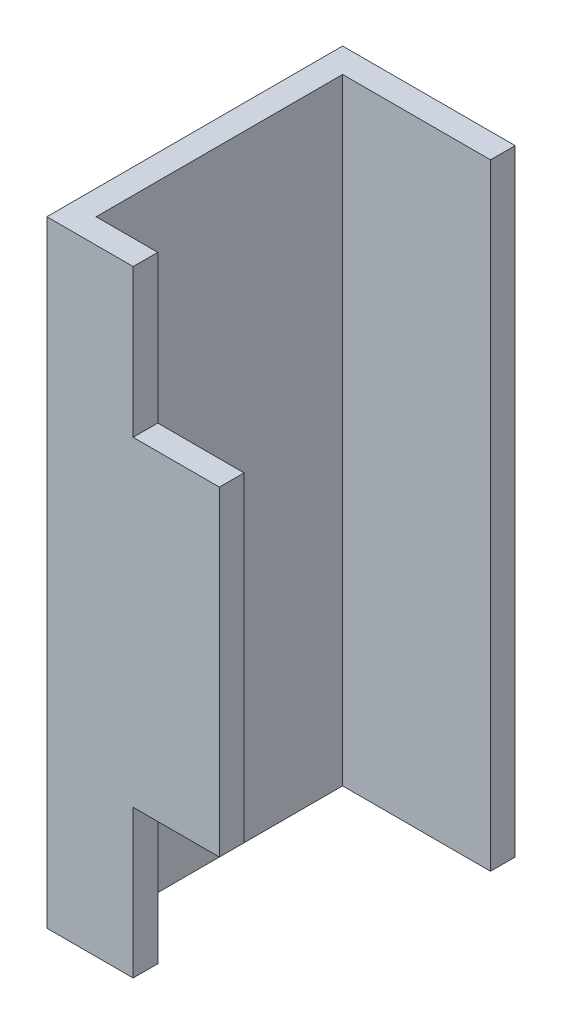
ISO-10303-21;
HEADER;
FILE_DESCRIPTION(('STEP AP214'),'2;1');
FILE_NAME('part.step','',(''),(''),'','','');
FILE_SCHEMA(('AUTOMOTIVE_DESIGN { 1 0 10303 214 1 1 1 1 }'));
ENDSEC;
DATA;
#1=APPLICATION_CONTEXT('core data for automotive mechanical design processes');
#2=APPLICATION_PROTOCOL_DEFINITION('international standard','automotive_design',2000,#1);
#3=PRODUCT_CONTEXT('',#1,'mechanical');
#4=PRODUCT('Part','Part','',(#3));
#5=PRODUCT_RELATED_PRODUCT_CATEGORY('part','',(#4));
#6=PRODUCT_DEFINITION_FORMATION('','',#4);
#7=PRODUCT_DEFINITION_CONTEXT('part definition',#1,'design');
#8=PRODUCT_DEFINITION('design','',#6,#7);
#9=PRODUCT_DEFINITION_SHAPE('','',#8);
#10=(LENGTH_UNIT() NAMED_UNIT(*) SI_UNIT(.MILLI.,.METRE.));
#11=(NAMED_UNIT(*) PLANE_ANGLE_UNIT() SI_UNIT($,.RADIAN.));
#12=(NAMED_UNIT(*) SI_UNIT($,.STERADIAN.) SOLID_ANGLE_UNIT());
#13=UNCERTAINTY_MEASURE_WITH_UNIT(LENGTH_MEASURE(1.E-05),#10,'distance_accuracy_value','');
#14=(GEOMETRIC_REPRESENTATION_CONTEXT(3) GLOBAL_UNCERTAINTY_ASSIGNED_CONTEXT((#13)) GLOBAL_UNIT_ASSIGNED_CONTEXT((#10,
#11,#12)) REPRESENTATION_CONTEXT('',''));
#15=CARTESIAN_POINT('',(0.,0.,0.));
#16=DIRECTION('',(0.,0.,1.));
#17=DIRECTION('',(1.,0.,0.));
#18=AXIS2_PLACEMENT_3D('',#15,#16,#17);
#19=CARTESIAN_POINT('',(1.9,1.94462219947249,0.549999999999999));
#20=DIRECTION('',(0.,0.,1.));
#21=DIRECTION('',(-1.,0.,0.));
#22=AXIS2_PLACEMENT_3D('',#19,#20,#21);
#23=PLANE('',#22);
#24=DIRECTION('',(0.,-1.,0.));
#25=VECTOR('',#24,1.);
#26=CARTESIAN_POINT('',(0.125,0.3,0.549999999999999));
#27=LINE('',#26,#25);
#28=CARTESIAN_POINT('',(0.125,0.3,0.549999999999999));
#29=VERTEX_POINT('',#28);
#30=CARTESIAN_POINT('',(0.125,0.,0.55));
#31=VERTEX_POINT('',#30);
#32=EDGE_CURVE('E11',#29,#31,#27,.T.);
#33=ORIENTED_EDGE('',*,*,#32,.F.);
#34=DIRECTION('',(-1.,0.,0.));
#35=VECTOR('',#34,1.);
#36=CARTESIAN_POINT('',(0.300000000000001,0.3,0.549999999999999));
#37=LINE('',#36,#35);
#38=CARTESIAN_POINT('',(0.300000000000001,0.3,0.549999999999999));
#39=VERTEX_POINT('',#38);
#40=EDGE_CURVE('E199',#39,#29,#37,.T.);
#41=ORIENTED_EDGE('',*,*,#40,.F.);
#42=DIRECTION('',(0.,-1.,0.));
#43=VECTOR('',#42,1.);
#44=CARTESIAN_POINT('',(0.3,0.95,0.55));
#45=LINE('',#44,#43);
#46=CARTESIAN_POINT('',(0.300000000000001,0.95,0.549999999999999));
#47=VERTEX_POINT('',#46);
#48=EDGE_CURVE('E192',#47,#39,#45,.T.);
#49=ORIENTED_EDGE('',*,*,#48,.F.);
#50=DIRECTION('',(1.,0.,0.));
#51=VECTOR('',#50,1.);
#52=CARTESIAN_POINT('',(0.125,0.95,0.549999999999999));
#53=LINE('',#52,#51);
#54=CARTESIAN_POINT('',(0.125,0.95,0.549999999999999));
#55=VERTEX_POINT('',#54);
#56=EDGE_CURVE('E184',#55,#47,#53,.T.);
#57=ORIENTED_EDGE('',*,*,#56,.F.);
#58=DIRECTION('',(0.,-1.,0.));
#59=VECTOR('',#58,1.);
#60=CARTESIAN_POINT('',(0.125,1.25,0.549999999999999));
#61=LINE('',#60,#59);
#62=CARTESIAN_POINT('',(0.125,1.25,0.549999999999999));
#63=VERTEX_POINT('',#62);
#64=EDGE_CURVE('E119',#63,#55,#61,.T.);
#65=ORIENTED_EDGE('',*,*,#64,.F.);
#66=DIRECTION('',(-1.,0.,0.));
#67=VECTOR('',#66,1.);
#68=CARTESIAN_POINT('',(0.125,1.25,0.55));
#69=LINE('',#68,#67);
#70=CARTESIAN_POINT('',(-0.0499999999999999,1.25,0.55));
#71=VERTEX_POINT('',#70);
#72=EDGE_CURVE('E164',#63,#71,#69,.T.);
#73=ORIENTED_EDGE('',*,*,#72,.T.);
#74=DIRECTION('',(0.,-1.,0.));
#75=VECTOR('',#74,1.);
#76=CARTESIAN_POINT('',(-0.0499999999999999,1.25,0.55));
#77=LINE('',#76,#75);
#78=CARTESIAN_POINT('',(-0.0499999999999999,0.,0.55));
#79=VERTEX_POINT('',#78);
#80=EDGE_CURVE('E173',#71,#79,#77,.T.);
#81=ORIENTED_EDGE('',*,*,#80,.T.);
#82=DIRECTION('',(1.,0.,0.));
#83=VECTOR('',#82,1.);
#84=CARTESIAN_POINT('',(-0.0499999999999998,0.,0.55));
#85=LINE('',#84,#83);
#86=EDGE_CURVE('E146',#79,#31,#85,.T.);
#87=ORIENTED_EDGE('',*,*,#86,.T.);
#88=EDGE_LOOP('',(#33,#41,#49,#57,#65,#73,#81,#87));
#89=FACE_BOUND('',#88,.T.);
#90=ADVANCED_FACE('F17',(#89),#23,.T.);
#91=CARTESIAN_POINT('',(-0.0499999999999999,1.94462219947249,0.));
#92=DIRECTION('',(-1.,0.,0.));
#93=DIRECTION('',(0.,0.,-1.));
#94=AXIS2_PLACEMENT_3D('',#91,#92,#93);
#95=PLANE('',#94);
#96=DIRECTION('',(0.,0.,-1.));
#97=VECTOR('',#96,1.);
#98=CARTESIAN_POINT('',(-0.0499999999999999,1.25,0.55));
#99=LINE('',#98,#97);
#100=CARTESIAN_POINT('',(-0.0499999999999999,1.25,-0.0499999999999999));
#101=VERTEX_POINT('',#100);
#102=EDGE_CURVE('E24',#71,#101,#99,.T.);
#103=ORIENTED_EDGE('',*,*,#102,.T.);
#104=DIRECTION('',(0.,-1.,0.));
#105=VECTOR('',#104,1.);
#106=CARTESIAN_POINT('',(-0.0499999999999999,1.25,-0.0499999999999999));
#107=LINE('',#106,#105);
#108=CARTESIAN_POINT('',(-0.0499999999999999,0.,-0.0499999999999999));
#109=VERTEX_POINT('',#108);
#110=EDGE_CURVE('E195',#101,#109,#107,.T.);
#111=ORIENTED_EDGE('',*,*,#110,.T.);
#112=DIRECTION('',(0.,0.,1.));
#113=VECTOR('',#112,1.);
#114=CARTESIAN_POINT('',(-0.0499999999999999,0.,-0.0499999999999999));
#115=LINE('',#114,#113);
#116=EDGE_CURVE('E186',#109,#79,#115,.T.);
#117=ORIENTED_EDGE('',*,*,#116,.T.);
#118=ORIENTED_EDGE('',*,*,#80,.F.);
#119=EDGE_LOOP('',(#103,#111,#117,#118));
#120=FACE_BOUND('',#119,.T.);
#121=ADVANCED_FACE('F226',(#120),#95,.T.);
#122=CARTESIAN_POINT('',(1.9,1.94462219947249,-0.0500000000000001));
#123=DIRECTION('',(0.,0.,-1.));
#124=DIRECTION('',(1.,0.,0.));
#125=AXIS2_PLACEMENT_3D('',#122,#123,#124);
#126=PLANE('',#125);
#127=DIRECTION('',(1.,0.,0.));
#128=VECTOR('',#127,1.);
#129=CARTESIAN_POINT('',(-0.0499999999999998,1.25,-0.0499999999999999));
#130=LINE('',#129,#128);
#131=CARTESIAN_POINT('',(0.3,1.25,-0.0499999999999999));
#132=VERTEX_POINT('',#131);
#133=EDGE_CURVE('E197',#101,#132,#130,.T.);
#134=ORIENTED_EDGE('',*,*,#133,.T.);
#135=DIRECTION('',(0.,-1.,0.));
#136=VECTOR('',#135,1.);
#137=CARTESIAN_POINT('',(0.3,1.25,-0.0499999999999999));
#138=LINE('',#137,#136);
#139=CARTESIAN_POINT('',(0.3,0.,-0.0499999999999999));
#140=VERTEX_POINT('',#139);
#141=EDGE_CURVE('E188',#132,#140,#138,.T.);
#142=ORIENTED_EDGE('',*,*,#141,.T.);
#143=DIRECTION('',(-1.,0.,0.));
#144=VECTOR('',#143,1.);
#145=CARTESIAN_POINT('',(0.3,0.,-0.0499999999999999));
#146=LINE('',#145,#144);
#147=EDGE_CURVE('E176',#140,#109,#146,.T.);
#148=ORIENTED_EDGE('',*,*,#147,.T.);
#149=ORIENTED_EDGE('',*,*,#110,.F.);
#150=EDGE_LOOP('',(#134,#142,#148,#149));
#151=FACE_BOUND('',#150,.T.);
#152=ADVANCED_FACE('F215',(#151),#126,.T.);
#153=CARTESIAN_POINT('',(0.3,1.94462219947249,0.));
#154=DIRECTION('',(-1.,0.,0.));
#155=DIRECTION('',(0.,0.,-1.));
#156=AXIS2_PLACEMENT_3D('',#153,#154,#155);
#157=PLANE('',#156);
#158=DIRECTION('',(0.,-1.,0.));
#159=VECTOR('',#158,1.);
#160=CARTESIAN_POINT('',(0.3,1.25,0.));
#161=LINE('',#160,#159);
#162=CARTESIAN_POINT('',(0.3,1.25,0.));
#163=VERTEX_POINT('',#162);
#164=CARTESIAN_POINT('',(0.3,0.,0.));
#165=VERTEX_POINT('',#164);
#166=EDGE_CURVE('E190',#163,#165,#161,.T.);
#167=ORIENTED_EDGE('',*,*,#166,.T.);
#168=DIRECTION('',(0.,0.,1.));
#169=VECTOR('',#168,1.);
#170=CARTESIAN_POINT('',(0.3,0.,-0.0499999999999999));
#171=LINE('',#170,#169);
#172=EDGE_CURVE('E179',#140,#165,#171,.T.);
#173=ORIENTED_EDGE('',*,*,#172,.F.);
#174=ORIENTED_EDGE('',*,*,#141,.F.);
#175=DIRECTION('',(0.,0.,-1.));
#176=VECTOR('',#175,1.);
#177=CARTESIAN_POINT('',(0.3,1.25,0.));
#178=LINE('',#177,#176);
#179=EDGE_CURVE('E156',#163,#132,#178,.T.);
#180=ORIENTED_EDGE('',*,*,#179,.F.);
#181=EDGE_LOOP('',(#167,#173,#174,#180));
#182=FACE_BOUND('',#181,.T.);
#183=ADVANCED_FACE('F218',(#182),#157,.F.);
#184=CARTESIAN_POINT('',(1.9,1.94462219947249,0.));
#185=DIRECTION('',(0.,0.,-1.));
#186=DIRECTION('',(1.,0.,0.));
#187=AXIS2_PLACEMENT_3D('',#184,#185,#186);
#188=PLANE('',#187);
#189=DIRECTION('',(0.,-1.,0.));
#190=VECTOR('',#189,1.);
#191=CARTESIAN_POINT('',(0.,1.25,0.));
#192=LINE('',#191,#190);
#193=CARTESIAN_POINT('',(0.,1.25,0.));
#194=VERTEX_POINT('',#193);
#195=CARTESIAN_POINT('',(0.,0.,0.));
#196=VERTEX_POINT('',#195);
#197=EDGE_CURVE('E182',#194,#196,#192,.T.);
#198=ORIENTED_EDGE('',*,*,#197,.T.);
#199=DIRECTION('',(-1.,0.,0.));
#200=VECTOR('',#199,1.);
#201=CARTESIAN_POINT('',(0.3,0.,0.));
#202=LINE('',#201,#200);
#203=EDGE_CURVE('E167',#165,#196,#202,.T.);
#204=ORIENTED_EDGE('',*,*,#203,.F.);
#205=ORIENTED_EDGE('',*,*,#166,.F.);
#206=DIRECTION('',(1.,0.,0.));
#207=VECTOR('',#206,1.);
#208=CARTESIAN_POINT('',(0.,1.25,0.));
#209=LINE('',#208,#207);
#210=EDGE_CURVE('E148',#194,#163,#209,.T.);
#211=ORIENTED_EDGE('',*,*,#210,.F.);
#212=EDGE_LOOP('',(#198,#204,#205,#211));
#213=FACE_BOUND('',#212,.T.);
#214=ADVANCED_FACE('F235',(#213),#188,.F.);
#215=CARTESIAN_POINT('',(0.,1.94462219947249,0.));
#216=DIRECTION('',(-1.,0.,0.));
#217=DIRECTION('',(0.,0.,-1.));
#218=AXIS2_PLACEMENT_3D('',#215,#216,#217);
#219=PLANE('',#218);
#220=DIRECTION('',(0.,-1.,0.));
#221=VECTOR('',#220,1.);
#222=CARTESIAN_POINT('',(0.,1.25,0.5));
#223=LINE('',#222,#221);
#224=CARTESIAN_POINT('',(0.,1.25,0.5));
#225=VERTEX_POINT('',#224);
#226=CARTESIAN_POINT('',(0.,0.,0.5));
#227=VERTEX_POINT('',#226);
#228=EDGE_CURVE('E170',#225,#227,#223,.T.);
#229=ORIENTED_EDGE('',*,*,#228,.T.);
#230=DIRECTION('',(0.,0.,1.));
#231=VECTOR('',#230,1.);
#232=CARTESIAN_POINT('',(0.,0.,0.));
#233=LINE('',#232,#231);
#234=EDGE_CURVE('E159',#196,#227,#233,.T.);
#235=ORIENTED_EDGE('',*,*,#234,.F.);
#236=ORIENTED_EDGE('',*,*,#197,.F.);
#237=DIRECTION('',(0.,0.,-1.));
#238=VECTOR('',#237,1.);
#239=CARTESIAN_POINT('',(0.,1.25,0.5));
#240=LINE('',#239,#238);
#241=EDGE_CURVE('E135',#225,#194,#240,.T.);
#242=ORIENTED_EDGE('',*,*,#241,.F.);
#243=EDGE_LOOP('',(#229,#235,#236,#242));
#244=FACE_BOUND('',#243,.T.);
#245=ADVANCED_FACE('F232',(#244),#219,.F.);
#246=CARTESIAN_POINT('',(1.9,1.94462219947249,0.5));
#247=DIRECTION('',(0.,0.,1.));
#248=DIRECTION('',(-1.,0.,0.));
#249=AXIS2_PLACEMENT_3D('',#246,#247,#248);
#250=PLANE('',#249);
#251=DIRECTION('',(-1.,0.,0.));
#252=VECTOR('',#251,1.);
#253=CARTESIAN_POINT('',(0.3,0.3,0.5));
#254=LINE('',#253,#252);
#255=CARTESIAN_POINT('',(0.300000000000001,0.3,0.5));
#256=VERTEX_POINT('',#255);
#257=CARTESIAN_POINT('',(0.125,0.3,0.5));
#258=VERTEX_POINT('',#257);
#259=EDGE_CURVE('E162',#256,#258,#254,.T.);
#260=ORIENTED_EDGE('',*,*,#259,.T.);
#261=DIRECTION('',(0.,-1.,0.));
#262=VECTOR('',#261,1.);
#263=CARTESIAN_POINT('',(0.125,0.3,0.5));
#264=LINE('',#263,#262);
#265=CARTESIAN_POINT('',(0.125,0.,0.5));
#266=VERTEX_POINT('',#265);
#267=EDGE_CURVE('E151',#258,#266,#264,.T.);
#268=ORIENTED_EDGE('',*,*,#267,.T.);
#269=DIRECTION('',(1.,0.,0.));
#270=VECTOR('',#269,1.);
#271=CARTESIAN_POINT('',(0.,0.,0.5));
#272=LINE('',#271,#270);
#273=EDGE_CURVE('E138',#227,#266,#272,.T.);
#274=ORIENTED_EDGE('',*,*,#273,.F.);
#275=ORIENTED_EDGE('',*,*,#228,.F.);
#276=DIRECTION('',(-1.,0.,0.));
#277=VECTOR('',#276,1.);
#278=CARTESIAN_POINT('',(0.125,1.25,0.5));
#279=LINE('',#278,#277);
#280=CARTESIAN_POINT('',(0.125,1.25,0.5));
#281=VERTEX_POINT('',#280);
#282=EDGE_CURVE('E111',#281,#225,#279,.T.);
#283=ORIENTED_EDGE('',*,*,#282,.F.);
#284=DIRECTION('',(0.,-1.,0.));
#285=VECTOR('',#284,1.);
#286=CARTESIAN_POINT('',(0.125,1.25,0.5));
#287=LINE('',#286,#285);
#288=CARTESIAN_POINT('',(0.125,0.95,0.5));
#289=VERTEX_POINT('',#288);
#290=EDGE_CURVE('E103',#281,#289,#287,.T.);
#291=ORIENTED_EDGE('',*,*,#290,.T.);
#292=DIRECTION('',(1.,0.,0.));
#293=VECTOR('',#292,1.);
#294=CARTESIAN_POINT('',(0.125000000000001,0.95,0.5));
#295=LINE('',#294,#293);
#296=CARTESIAN_POINT('',(0.300000000000001,0.95,0.5));
#297=VERTEX_POINT('',#296);
#298=EDGE_CURVE('E108',#289,#297,#295,.T.);
#299=ORIENTED_EDGE('',*,*,#298,.T.);
#300=DIRECTION('',(0.,-1.,0.));
#301=VECTOR('',#300,1.);
#302=CARTESIAN_POINT('',(0.3,0.95,0.5));
#303=LINE('',#302,#301);
#304=EDGE_CURVE('E141',#297,#256,#303,.T.);
#305=ORIENTED_EDGE('',*,*,#304,.T.);
#306=EDGE_LOOP('',(#260,#268,#274,#275,#283,#291,#299,#305));
#307=FACE_BOUND('',#306,.T.);
#308=ADVANCED_FACE('F105',(#307),#250,.F.);
#309=CARTESIAN_POINT('',(0.3,1.94462219947249,0.));
#310=DIRECTION('',(1.,0.,0.));
#311=DIRECTION('',(0.,0.,1.));
#312=AXIS2_PLACEMENT_3D('',#309,#310,#311);
#313=PLANE('',#312);
#314=DIRECTION('',(0.,0.,1.));
#315=VECTOR('',#314,1.);
#316=CARTESIAN_POINT('',(0.300000000000001,0.3,0.5));
#317=LINE('',#316,#315);
#318=EDGE_CURVE('E153',#256,#39,#317,.T.);
#319=ORIENTED_EDGE('',*,*,#318,.F.);
#320=ORIENTED_EDGE('',*,*,#304,.F.);
#321=DIRECTION('',(0.,0.,1.));
#322=VECTOR('',#321,1.);
#323=CARTESIAN_POINT('',(0.300000000000001,0.95,0.5));
#324=LINE('',#323,#322);
#325=EDGE_CURVE('E122',#297,#47,#324,.T.);
#326=ORIENTED_EDGE('',*,*,#325,.T.);
#327=ORIENTED_EDGE('',*,*,#48,.T.);
#328=EDGE_LOOP('',(#319,#320,#326,#327));
#329=FACE_BOUND('',#328,.T.);
#330=ADVANCED_FACE('F207',(#329),#313,.T.);
#331=CARTESIAN_POINT('',(1.9,0.,0.));
#332=DIRECTION('',(0.,-1.,0.));
#333=DIRECTION('',(0.,0.,-1.));
#334=AXIS2_PLACEMENT_3D('',#331,#332,#333);
#335=PLANE('',#334);
#336=DIRECTION('',(0.,0.,-1.));
#337=VECTOR('',#336,1.);
#338=CARTESIAN_POINT('',(0.125,0.,0.55));
#339=LINE('',#338,#337);
#340=EDGE_CURVE('E143',#31,#266,#339,.T.);
#341=ORIENTED_EDGE('',*,*,#340,.F.);
#342=ORIENTED_EDGE('',*,*,#86,.F.);
#343=ORIENTED_EDGE('',*,*,#116,.F.);
#344=ORIENTED_EDGE('',*,*,#147,.F.);
#345=ORIENTED_EDGE('',*,*,#172,.T.);
#346=ORIENTED_EDGE('',*,*,#203,.T.);
#347=ORIENTED_EDGE('',*,*,#234,.T.);
#348=ORIENTED_EDGE('',*,*,#273,.T.);
#349=EDGE_LOOP('',(#341,#342,#343,#344,#345,#346,#347,#348));
#350=FACE_BOUND('',#349,.T.);
#351=ADVANCED_FACE('F224',(#350),#335,.T.);
#352=CARTESIAN_POINT('',(1.9,1.25,0.5));
#353=DIRECTION('',(0.,-1.,0.));
#354=DIRECTION('',(0.,0.,-1.));
#355=AXIS2_PLACEMENT_3D('',#352,#353,#354);
#356=PLANE('',#355);
#357=ORIENTED_EDGE('',*,*,#72,.F.);
#358=DIRECTION('',(0.,0.,-1.));
#359=VECTOR('',#358,1.);
#360=CARTESIAN_POINT('',(0.125,1.25,0.549999999999999));
#361=LINE('',#360,#359);
#362=EDGE_CURVE('E123',#63,#281,#361,.T.);
#363=ORIENTED_EDGE('',*,*,#362,.T.);
#364=ORIENTED_EDGE('',*,*,#282,.T.);
#365=ORIENTED_EDGE('',*,*,#241,.T.);
#366=ORIENTED_EDGE('',*,*,#210,.T.);
#367=ORIENTED_EDGE('',*,*,#179,.T.);
#368=ORIENTED_EDGE('',*,*,#133,.F.);
#369=ORIENTED_EDGE('',*,*,#102,.F.);
#370=EDGE_LOOP('',(#357,#363,#364,#365,#366,#367,#368,#369));
#371=FACE_BOUND('',#370,.T.);
#372=ADVANCED_FACE('F210',(#371),#356,.F.);
#373=CARTESIAN_POINT('',(0.300000000000001,0.95,0.449999999999999));
#374=DIRECTION('',(0.,-1.,0.));
#375=DIRECTION('',(0.,0.,-1.));
#376=AXIS2_PLACEMENT_3D('',#373,#374,#375);
#377=PLANE('',#376);
#378=DIRECTION('',(0.,0.,1.));
#379=VECTOR('',#378,1.);
#380=CARTESIAN_POINT('',(0.125,0.95,0.5));
#381=LINE('',#380,#379);
#382=EDGE_CURVE('E117',#289,#55,#381,.T.);
#383=ORIENTED_EDGE('',*,*,#382,.T.);
#384=ORIENTED_EDGE('',*,*,#56,.T.);
#385=ORIENTED_EDGE('',*,*,#325,.F.);
#386=ORIENTED_EDGE('',*,*,#298,.F.);
#387=EDGE_LOOP('',(#383,#384,#385,#386));
#388=FACE_BOUND('',#387,.T.);
#389=ADVANCED_FACE('F126',(#388),#377,.F.);
#390=CARTESIAN_POINT('',(0.125,1.25,0.449999999999999));
#391=DIRECTION('',(-1.,0.,0.));
#392=DIRECTION('',(0.,0.,1.));
#393=AXIS2_PLACEMENT_3D('',#390,#391,#392);
#394=PLANE('',#393);
#395=ORIENTED_EDGE('',*,*,#362,.F.);
#396=ORIENTED_EDGE('',*,*,#64,.T.);
#397=ORIENTED_EDGE('',*,*,#382,.F.);
#398=ORIENTED_EDGE('',*,*,#290,.F.);
#399=EDGE_LOOP('',(#395,#396,#397,#398));
#400=FACE_BOUND('',#399,.T.);
#401=ADVANCED_FACE('F118',(#400),#394,.F.);
#402=CARTESIAN_POINT('',(0.300000000000001,0.3,0.449999999999999));
#403=DIRECTION('',(0.,1.,0.));
#404=DIRECTION('',(0.,0.,1.));
#405=AXIS2_PLACEMENT_3D('',#402,#403,#404);
#406=PLANE('',#405);
#407=ORIENTED_EDGE('',*,*,#318,.T.);
#408=ORIENTED_EDGE('',*,*,#40,.T.);
#409=DIRECTION('',(0.,0.,1.));
#410=VECTOR('',#409,1.);
#411=CARTESIAN_POINT('',(0.125,0.3,0.5));
#412=LINE('',#411,#410);
#413=EDGE_CURVE('E128',#258,#29,#412,.T.);
#414=ORIENTED_EDGE('',*,*,#413,.F.);
#415=ORIENTED_EDGE('',*,*,#259,.F.);
#416=EDGE_LOOP('',(#407,#408,#414,#415));
#417=FACE_BOUND('',#416,.T.);
#418=ADVANCED_FACE('F203',(#417),#406,.F.);
#419=CARTESIAN_POINT('',(0.125,0.,0.449999999999999));
#420=DIRECTION('',(-1.,0.,0.));
#421=DIRECTION('',(0.,0.,1.));
#422=AXIS2_PLACEMENT_3D('',#419,#420,#421);
#423=PLANE('',#422);
#424=ORIENTED_EDGE('',*,*,#413,.T.);
#425=ORIENTED_EDGE('',*,*,#32,.T.);
#426=ORIENTED_EDGE('',*,*,#340,.T.);
#427=ORIENTED_EDGE('',*,*,#267,.F.);
#428=EDGE_LOOP('',(#424,#425,#426,#427));
#429=FACE_BOUND('',#428,.T.);
#430=ADVANCED_FACE('F229',(#429),#423,.F.);
#431=CLOSED_SHELL('',(#90,#121,#152,#183,#214,#245,#308,#330,#351,#372,#389,#401,#418,#430));
#432=MANIFOLD_SOLID_BREP('B1',#431);
#433=ADVANCED_BREP_SHAPE_REPRESENTATION('',(#18,#432),#14);
#434=SHAPE_DEFINITION_REPRESENTATION(#9,#433);
ENDSEC;
END-ISO-10303-21;
